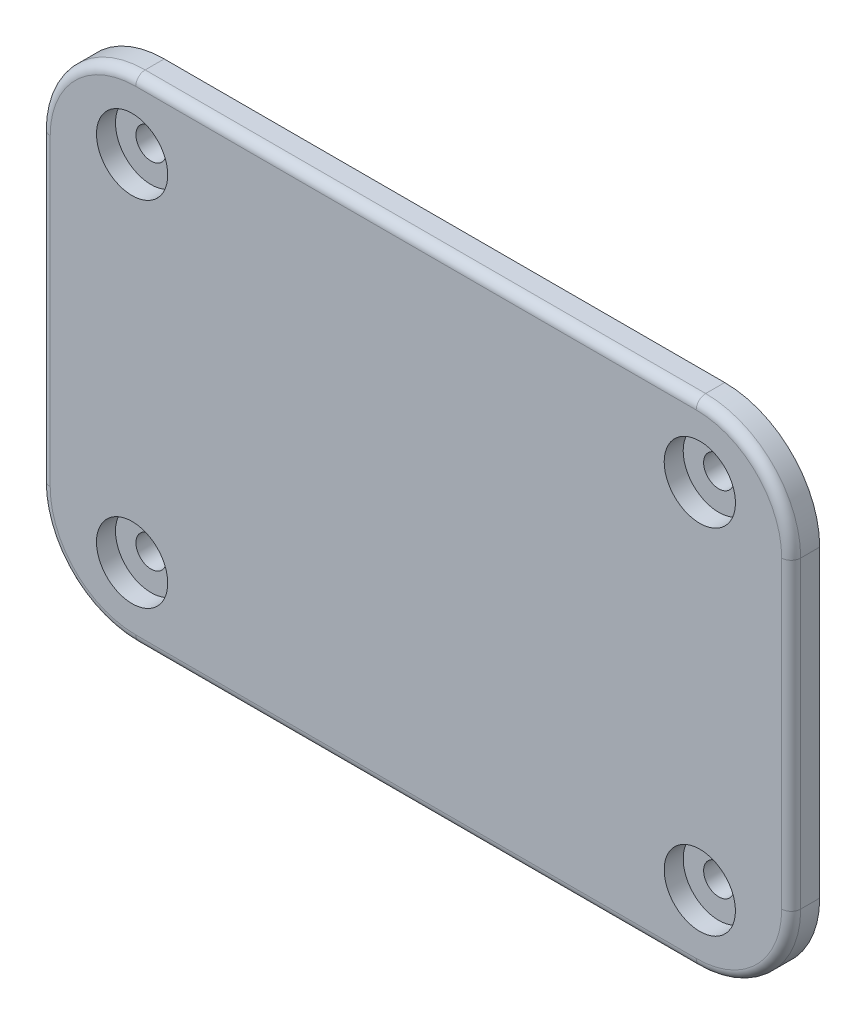
ISO-10303-21;
HEADER;
FILE_DESCRIPTION(('STEP AP214'),'2;1');
FILE_NAME('part.step','',(''),(''),'','','');
FILE_SCHEMA(('AUTOMOTIVE_DESIGN { 1 0 10303 214 1 1 1 1 }'));
ENDSEC;
DATA;
#1=APPLICATION_CONTEXT('core data for automotive mechanical design processes');
#2=APPLICATION_PROTOCOL_DEFINITION('international standard','automotive_design',2000,#1);
#3=PRODUCT_CONTEXT('',#1,'mechanical');
#4=PRODUCT('Part','Part','',(#3));
#5=PRODUCT_RELATED_PRODUCT_CATEGORY('part','',(#4));
#6=PRODUCT_DEFINITION_FORMATION('','',#4);
#7=PRODUCT_DEFINITION_CONTEXT('part definition',#1,'design');
#8=PRODUCT_DEFINITION('design','',#6,#7);
#9=PRODUCT_DEFINITION_SHAPE('','',#8);
#10=(LENGTH_UNIT() NAMED_UNIT(*) SI_UNIT(.MILLI.,.METRE.));
#11=(NAMED_UNIT(*) PLANE_ANGLE_UNIT() SI_UNIT($,.RADIAN.));
#12=(NAMED_UNIT(*) SI_UNIT($,.STERADIAN.) SOLID_ANGLE_UNIT());
#13=UNCERTAINTY_MEASURE_WITH_UNIT(LENGTH_MEASURE(1.E-05),#10,'distance_accuracy_value','');
#14=(GEOMETRIC_REPRESENTATION_CONTEXT(3) GLOBAL_UNCERTAINTY_ASSIGNED_CONTEXT((#13)) GLOBAL_UNIT_ASSIGNED_CONTEXT((#10,
#11,#12)) REPRESENTATION_CONTEXT('',''));
#15=CARTESIAN_POINT('',(0.,0.,0.));
#16=DIRECTION('',(0.,0.,1.));
#17=DIRECTION('',(1.,0.,0.));
#18=AXIS2_PLACEMENT_3D('',#15,#16,#17);
#19=CARTESIAN_POINT('',(29.879306909282,-18.5988431493967,-2.));
#20=DIRECTION('',(0.,0.,1.));
#21=DIRECTION('',(1.,0.,0.));
#22=AXIS2_PLACEMENT_3D('',#19,#20,#21);
#23=CYLINDRICAL_SURFACE('',#22,1.6);
#24=CARTESIAN_POINT('',(29.879306909282,-18.5988431493967,-1.5));
#25=DIRECTION('',(0.,0.,-1.));
#26=DIRECTION('',(-1.,0.,0.));
#27=AXIS2_PLACEMENT_3D('',#24,#25,#26);
#28=CIRCLE('',#27,1.6);
#29=CARTESIAN_POINT('',(28.279306909282,-18.5988431493967,-1.5));
#30=VERTEX_POINT('',#29);
#31=EDGE_CURVE('E297',#30,#30,#28,.T.);
#32=ORIENTED_EDGE('',*,*,#31,.T.);
#33=EDGE_LOOP('',(#32));
#34=FACE_BOUND('',#33,.T.);
#35=CARTESIAN_POINT('',(29.879306909282,-18.5988431493967,1.));
#36=DIRECTION('',(0.,0.,1.));
#37=DIRECTION('',(1.,0.,0.));
#38=AXIS2_PLACEMENT_3D('',#35,#36,#37);
#39=CIRCLE('',#38,1.6);
#40=CARTESIAN_POINT('',(31.479306909282,-18.5988431493967,1.));
#41=VERTEX_POINT('',#40);
#42=EDGE_CURVE('E40',#41,#41,#39,.F.);
#43=ORIENTED_EDGE('',*,*,#42,.F.);
#44=EDGE_LOOP('',(#43));
#45=FACE_BOUND('',#44,.T.);
#46=ADVANCED_FACE('F36',(#34,#45),#23,.F.);
#47=CARTESIAN_POINT('',(-29.879306909282,18.5988431493967,-2.));
#48=DIRECTION('',(0.,0.,1.));
#49=DIRECTION('',(1.,0.,0.));
#50=AXIS2_PLACEMENT_3D('',#47,#48,#49);
#51=CYLINDRICAL_SURFACE('',#50,1.6);
#52=CARTESIAN_POINT('',(-29.879306909282,18.5988431493967,-1.5));
#53=DIRECTION('',(0.,0.,-1.));
#54=DIRECTION('',(-1.,0.,0.));
#55=AXIS2_PLACEMENT_3D('',#52,#53,#54);
#56=CIRCLE('',#55,1.6);
#57=CARTESIAN_POINT('',(-31.479306909282,18.5988431493967,-1.5));
#58=VERTEX_POINT('',#57);
#59=EDGE_CURVE('E303',#58,#58,#56,.T.);
#60=ORIENTED_EDGE('',*,*,#59,.T.);
#61=EDGE_LOOP('',(#60));
#62=FACE_BOUND('',#61,.T.);
#63=CARTESIAN_POINT('',(-29.879306909282,18.5988431493967,1.));
#64=DIRECTION('',(0.,0.,1.));
#65=DIRECTION('',(1.,0.,0.));
#66=AXIS2_PLACEMENT_3D('',#63,#64,#65);
#67=CIRCLE('',#66,1.6);
#68=CARTESIAN_POINT('',(-28.279306909282,18.5988431493967,1.));
#69=VERTEX_POINT('',#68);
#70=EDGE_CURVE('E311',#69,#69,#67,.F.);
#71=ORIENTED_EDGE('',*,*,#70,.F.);
#72=EDGE_LOOP('',(#71));
#73=FACE_BOUND('',#72,.T.);
#74=ADVANCED_FACE('F324',(#62,#73),#51,.F.);
#75=CARTESIAN_POINT('',(29.5,-16.,0.));
#76=DIRECTION('',(0.,0.,1.));
#77=DIRECTION('',(1.,0.,0.));
#78=AXIS2_PLACEMENT_3D('',#75,#76,#77);
#79=PLANE('',#78);
#80=CARTESIAN_POINT('',(29.5,-16.,0.));
#81=DIRECTION('',(0.,0.,1.));
#82=DIRECTION('',(1.,0.,0.));
#83=AXIS2_PLACEMENT_3D('',#80,#81,#82);
#84=CIRCLE('',#83,10.);
#85=CARTESIAN_POINT('',(29.5,-26.,0.));
#86=VERTEX_POINT('',#85);
#87=CARTESIAN_POINT('',(39.5,-16.,0.));
#88=VERTEX_POINT('',#87);
#89=EDGE_CURVE('E199',#86,#88,#84,.T.);
#90=ORIENTED_EDGE('',*,*,#89,.F.);
#91=DIRECTION('',(1.,0.,0.));
#92=VECTOR('',#91,1.);
#93=CARTESIAN_POINT('',(-29.5,-26.,0.));
#94=LINE('',#93,#92);
#95=CARTESIAN_POINT('',(-29.5,-26.,0.));
#96=VERTEX_POINT('',#95);
#97=EDGE_CURVE('E225',#96,#86,#94,.T.);
#98=ORIENTED_EDGE('',*,*,#97,.F.);
#99=CARTESIAN_POINT('',(-29.5,-16.,0.));
#100=DIRECTION('',(0.,0.,1.));
#101=DIRECTION('',(-1.,0.,0.));
#102=AXIS2_PLACEMENT_3D('',#99,#100,#101);
#103=CIRCLE('',#102,10.);
#104=CARTESIAN_POINT('',(-39.5,-16.,0.));
#105=VERTEX_POINT('',#104);
#106=EDGE_CURVE('E222',#105,#96,#103,.T.);
#107=ORIENTED_EDGE('',*,*,#106,.F.);
#108=DIRECTION('',(0.,-1.,0.));
#109=VECTOR('',#108,1.);
#110=CARTESIAN_POINT('',(-39.5,-16.,0.));
#111=LINE('',#110,#109);
#112=CARTESIAN_POINT('',(-39.5,16.,0.));
#113=VERTEX_POINT('',#112);
#114=EDGE_CURVE('E219',#113,#105,#111,.T.);
#115=ORIENTED_EDGE('',*,*,#114,.F.);
#116=CARTESIAN_POINT('',(-29.5,16.,0.));
#117=DIRECTION('',(0.,0.,1.));
#118=DIRECTION('',(-1.,0.,0.));
#119=AXIS2_PLACEMENT_3D('',#116,#117,#118);
#120=CIRCLE('',#119,10.);
#121=CARTESIAN_POINT('',(-29.5,26.,0.));
#122=VERTEX_POINT('',#121);
#123=EDGE_CURVE('E216',#122,#113,#120,.T.);
#124=ORIENTED_EDGE('',*,*,#123,.F.);
#125=DIRECTION('',(-1.,0.,0.));
#126=VECTOR('',#125,1.);
#127=CARTESIAN_POINT('',(-29.5,26.,0.));
#128=LINE('',#127,#126);
#129=CARTESIAN_POINT('',(29.5,26.,0.));
#130=VERTEX_POINT('',#129);
#131=EDGE_CURVE('E213',#130,#122,#128,.T.);
#132=ORIENTED_EDGE('',*,*,#131,.F.);
#133=CARTESIAN_POINT('',(29.5,16.,0.));
#134=DIRECTION('',(0.,0.,1.));
#135=DIRECTION('',(-1.,0.,0.));
#136=AXIS2_PLACEMENT_3D('',#133,#134,#135);
#137=CIRCLE('',#136,10.);
#138=CARTESIAN_POINT('',(39.5,16.,0.));
#139=VERTEX_POINT('',#138);
#140=EDGE_CURVE('E210',#139,#130,#137,.T.);
#141=ORIENTED_EDGE('',*,*,#140,.F.);
#142=DIRECTION('',(0.,1.,0.));
#143=VECTOR('',#142,1.);
#144=CARTESIAN_POINT('',(39.5,-16.,0.));
#145=LINE('',#144,#143);
#146=EDGE_CURVE('E202',#88,#139,#145,.T.);
#147=ORIENTED_EDGE('',*,*,#146,.F.);
#148=EDGE_LOOP('',(#90,#98,#107,#115,#124,#132,#141,#147));
#149=FACE_BOUND('',#148,.T.);
#150=CARTESIAN_POINT('',(29.5,-16.,0.));
#151=DIRECTION('',(0.,0.,-1.));
#152=DIRECTION('',(-1.,0.,0.));
#153=AXIS2_PLACEMENT_3D('',#150,#151,#152);
#154=CIRCLE('',#153,5.85);
#155=CARTESIAN_POINT('',(35.35,-16.,0.));
#156=VERTEX_POINT('',#155);
#157=CARTESIAN_POINT('',(29.5,-21.85,0.));
#158=VERTEX_POINT('',#157);
#159=EDGE_CURVE('E198',#156,#158,#154,.T.);
#160=ORIENTED_EDGE('',*,*,#159,.F.);
#161=DIRECTION('',(0.,-1.,0.));
#162=VECTOR('',#161,1.);
#163=CARTESIAN_POINT('',(35.35,16.,0.));
#164=LINE('',#163,#162);
#165=CARTESIAN_POINT('',(35.35,16.,0.));
#166=VERTEX_POINT('',#165);
#167=EDGE_CURVE('E195',#166,#156,#164,.T.);
#168=ORIENTED_EDGE('',*,*,#167,.F.);
#169=CARTESIAN_POINT('',(29.5,16.,0.));
#170=DIRECTION('',(0.,0.,-1.));
#171=DIRECTION('',(-1.,0.,0.));
#172=AXIS2_PLACEMENT_3D('',#169,#170,#171);
#173=CIRCLE('',#172,5.85);
#174=CARTESIAN_POINT('',(29.5,21.85,0.));
#175=VERTEX_POINT('',#174);
#176=EDGE_CURVE('E480',#175,#166,#173,.T.);
#177=ORIENTED_EDGE('',*,*,#176,.F.);
#178=DIRECTION('',(1.,0.,0.));
#179=VECTOR('',#178,1.);
#180=CARTESIAN_POINT('',(-29.5,21.85,0.));
#181=LINE('',#180,#179);
#182=CARTESIAN_POINT('',(-29.5,21.85,0.));
#183=VERTEX_POINT('',#182);
#184=EDGE_CURVE('E512',#183,#175,#181,.T.);
#185=ORIENTED_EDGE('',*,*,#184,.F.);
#186=CARTESIAN_POINT('',(-29.5,16.,0.));
#187=DIRECTION('',(0.,0.,-1.));
#188=DIRECTION('',(-1.,0.,0.));
#189=AXIS2_PLACEMENT_3D('',#186,#187,#188);
#190=CIRCLE('',#189,5.85);
#191=CARTESIAN_POINT('',(-35.35,16.,0.));
#192=VERTEX_POINT('',#191);
#193=EDGE_CURVE('E506',#192,#183,#190,.T.);
#194=ORIENTED_EDGE('',*,*,#193,.F.);
#195=DIRECTION('',(0.,1.,0.));
#196=VECTOR('',#195,1.);
#197=CARTESIAN_POINT('',(-35.35,-16.,0.));
#198=LINE('',#197,#196);
#199=CARTESIAN_POINT('',(-35.35,-16.,0.));
#200=VERTEX_POINT('',#199);
#201=EDGE_CURVE('E501',#200,#192,#198,.T.);
#202=ORIENTED_EDGE('',*,*,#201,.F.);
#203=CARTESIAN_POINT('',(-29.5,-16.,0.));
#204=DIRECTION('',(0.,0.,-1.));
#205=DIRECTION('',(-1.,0.,0.));
#206=AXIS2_PLACEMENT_3D('',#203,#204,#205);
#207=CIRCLE('',#206,5.85);
#208=CARTESIAN_POINT('',(-29.5,-21.85,0.));
#209=VERTEX_POINT('',#208);
#210=EDGE_CURVE('E504',#209,#200,#207,.T.);
#211=ORIENTED_EDGE('',*,*,#210,.F.);
#212=DIRECTION('',(-1.,0.,0.));
#213=VECTOR('',#212,1.);
#214=CARTESIAN_POINT('',(29.5,-21.85,0.));
#215=LINE('',#214,#213);
#216=EDGE_CURVE('E474',#158,#209,#215,.T.);
#217=ORIENTED_EDGE('',*,*,#216,.F.);
#218=EDGE_LOOP('',(#160,#168,#177,#185,#194,#202,#211,#217));
#219=FACE_BOUND('',#218,.T.);
#220=ADVANCED_FACE('F330',(#149,#219),#79,.F.);
#221=CARTESIAN_POINT('',(29.5,-16.,3.));
#222=DIRECTION('',(0.,0.,-1.));
#223=DIRECTION('',(-1.,0.,0.));
#224=AXIS2_PLACEMENT_3D('',#221,#222,#223);
#225=CYLINDRICAL_SURFACE('',#224,10.);
#226=DIRECTION('',(0.,0.,-1.));
#227=VECTOR('',#226,1.);
#228=CARTESIAN_POINT('',(39.5,-16.,3.));
#229=LINE('',#228,#227);
#230=CARTESIAN_POINT('',(39.5,-16.,2.));
#231=VERTEX_POINT('',#230);
#232=EDGE_CURVE('E242',#231,#88,#229,.T.);
#233=ORIENTED_EDGE('',*,*,#232,.F.);
#234=CARTESIAN_POINT('',(29.5,-16.,2.));
#235=DIRECTION('',(0.,0.,1.));
#236=DIRECTION('',(1.,0.,0.));
#237=AXIS2_PLACEMENT_3D('',#234,#235,#236);
#238=CIRCLE('',#237,10.);
#239=CARTESIAN_POINT('',(29.5,-26.,2.));
#240=VERTEX_POINT('',#239);
#241=EDGE_CURVE('E11',#231,#240,#238,.F.);
#242=ORIENTED_EDGE('',*,*,#241,.T.);
#243=DIRECTION('',(0.,0.,-1.));
#244=VECTOR('',#243,1.);
#245=CARTESIAN_POINT('',(29.5,-26.,3.));
#246=LINE('',#245,#244);
#247=EDGE_CURVE('E228',#240,#86,#246,.T.);
#248=ORIENTED_EDGE('',*,*,#247,.T.);
#249=ORIENTED_EDGE('',*,*,#89,.T.);
#250=EDGE_LOOP('',(#233,#242,#248,#249));
#251=FACE_BOUND('',#250,.T.);
#252=ADVANCED_FACE('F374',(#251),#225,.T.);
#253=CARTESIAN_POINT('',(39.5,-16.,3.));
#254=DIRECTION('',(-1.,0.,0.));
#255=DIRECTION('',(0.,0.,1.));
#256=AXIS2_PLACEMENT_3D('',#253,#254,#255);
#257=PLANE('',#256);
#258=DIRECTION('',(0.,0.,-1.));
#259=VECTOR('',#258,1.);
#260=CARTESIAN_POINT('',(39.5,16.,3.));
#261=LINE('',#260,#259);
#262=CARTESIAN_POINT('',(39.5,16.,2.));
#263=VERTEX_POINT('',#262);
#264=EDGE_CURVE('E240',#263,#139,#261,.T.);
#265=ORIENTED_EDGE('',*,*,#264,.F.);
#266=DIRECTION('',(0.,1.,0.));
#267=VECTOR('',#266,1.);
#268=CARTESIAN_POINT('',(39.5,-16.,2.));
#269=LINE('',#268,#267);
#270=EDGE_CURVE('E45',#263,#231,#269,.F.);
#271=ORIENTED_EDGE('',*,*,#270,.T.);
#272=ORIENTED_EDGE('',*,*,#232,.T.);
#273=ORIENTED_EDGE('',*,*,#146,.T.);
#274=EDGE_LOOP('',(#265,#271,#272,#273));
#275=FACE_BOUND('',#274,.T.);
#276=ADVANCED_FACE('F398',(#275),#257,.F.);
#277=CARTESIAN_POINT('',(29.5,16.,3.));
#278=DIRECTION('',(0.,0.,-1.));
#279=DIRECTION('',(-1.,0.,0.));
#280=AXIS2_PLACEMENT_3D('',#277,#278,#279);
#281=CYLINDRICAL_SURFACE('',#280,10.);
#282=DIRECTION('',(0.,0.,-1.));
#283=VECTOR('',#282,1.);
#284=CARTESIAN_POINT('',(29.5,26.,3.));
#285=LINE('',#284,#283);
#286=CARTESIAN_POINT('',(29.5,26.,2.));
#287=VERTEX_POINT('',#286);
#288=EDGE_CURVE('E238',#287,#130,#285,.T.);
#289=ORIENTED_EDGE('',*,*,#288,.F.);
#290=CARTESIAN_POINT('',(29.5,16.,2.));
#291=DIRECTION('',(0.,0.,1.));
#292=DIRECTION('',(1.,0.,0.));
#293=AXIS2_PLACEMENT_3D('',#290,#291,#292);
#294=CIRCLE('',#293,10.);
#295=EDGE_CURVE('E60',#287,#263,#294,.F.);
#296=ORIENTED_EDGE('',*,*,#295,.T.);
#297=ORIENTED_EDGE('',*,*,#264,.T.);
#298=ORIENTED_EDGE('',*,*,#140,.T.);
#299=EDGE_LOOP('',(#289,#296,#297,#298));
#300=FACE_BOUND('',#299,.T.);
#301=ADVANCED_FACE('F394',(#300),#281,.T.);
#302=CARTESIAN_POINT('',(-29.5,26.,3.));
#303=DIRECTION('',(0.,-1.,0.));
#304=DIRECTION('',(0.,0.,-1.));
#305=AXIS2_PLACEMENT_3D('',#302,#303,#304);
#306=PLANE('',#305);
#307=DIRECTION('',(0.,0.,-1.));
#308=VECTOR('',#307,1.);
#309=CARTESIAN_POINT('',(-29.5,26.,3.));
#310=LINE('',#309,#308);
#311=CARTESIAN_POINT('',(-29.5,26.,2.));
#312=VERTEX_POINT('',#311);
#313=EDGE_CURVE('E236',#312,#122,#310,.T.);
#314=ORIENTED_EDGE('',*,*,#313,.F.);
#315=DIRECTION('',(-1.,0.,0.));
#316=VECTOR('',#315,1.);
#317=CARTESIAN_POINT('',(29.5,26.,2.));
#318=LINE('',#317,#316);
#319=EDGE_CURVE('E270',#312,#287,#318,.F.);
#320=ORIENTED_EDGE('',*,*,#319,.T.);
#321=ORIENTED_EDGE('',*,*,#288,.T.);
#322=ORIENTED_EDGE('',*,*,#131,.T.);
#323=EDGE_LOOP('',(#314,#320,#321,#322));
#324=FACE_BOUND('',#323,.T.);
#325=ADVANCED_FACE('F390',(#324),#306,.F.);
#326=CARTESIAN_POINT('',(-29.5,16.,3.));
#327=DIRECTION('',(0.,0.,-1.));
#328=DIRECTION('',(-1.,0.,0.));
#329=AXIS2_PLACEMENT_3D('',#326,#327,#328);
#330=CYLINDRICAL_SURFACE('',#329,10.);
#331=DIRECTION('',(0.,0.,-1.));
#332=VECTOR('',#331,1.);
#333=CARTESIAN_POINT('',(-39.5,16.,3.));
#334=LINE('',#333,#332);
#335=CARTESIAN_POINT('',(-39.5,16.,2.));
#336=VERTEX_POINT('',#335);
#337=EDGE_CURVE('E234',#336,#113,#334,.T.);
#338=ORIENTED_EDGE('',*,*,#337,.F.);
#339=CARTESIAN_POINT('',(-29.5,16.,2.));
#340=DIRECTION('',(0.,0.,1.));
#341=DIRECTION('',(1.,0.,0.));
#342=AXIS2_PLACEMENT_3D('',#339,#340,#341);
#343=CIRCLE('',#342,10.);
#344=EDGE_CURVE('E268',#336,#312,#343,.F.);
#345=ORIENTED_EDGE('',*,*,#344,.T.);
#346=ORIENTED_EDGE('',*,*,#313,.T.);
#347=ORIENTED_EDGE('',*,*,#123,.T.);
#348=EDGE_LOOP('',(#338,#345,#346,#347));
#349=FACE_BOUND('',#348,.T.);
#350=ADVANCED_FACE('F386',(#349),#330,.T.);
#351=CARTESIAN_POINT('',(-39.5,-16.,3.));
#352=DIRECTION('',(1.,0.,0.));
#353=DIRECTION('',(0.,0.,-1.));
#354=AXIS2_PLACEMENT_3D('',#351,#352,#353);
#355=PLANE('',#354);
#356=DIRECTION('',(0.,0.,-1.));
#357=VECTOR('',#356,1.);
#358=CARTESIAN_POINT('',(-39.5,-16.,3.));
#359=LINE('',#358,#357);
#360=CARTESIAN_POINT('',(-39.5,-16.,2.));
#361=VERTEX_POINT('',#360);
#362=EDGE_CURVE('E232',#361,#105,#359,.T.);
#363=ORIENTED_EDGE('',*,*,#362,.F.);
#364=DIRECTION('',(0.,-1.,0.));
#365=VECTOR('',#364,1.);
#366=CARTESIAN_POINT('',(-39.5,16.,2.));
#367=LINE('',#366,#365);
#368=EDGE_CURVE('E266',#361,#336,#367,.F.);
#369=ORIENTED_EDGE('',*,*,#368,.T.);
#370=ORIENTED_EDGE('',*,*,#337,.T.);
#371=ORIENTED_EDGE('',*,*,#114,.T.);
#372=EDGE_LOOP('',(#363,#369,#370,#371));
#373=FACE_BOUND('',#372,.T.);
#374=ADVANCED_FACE('F382',(#373),#355,.F.);
#375=CARTESIAN_POINT('',(-29.5,-16.,3.));
#376=DIRECTION('',(0.,0.,-1.));
#377=DIRECTION('',(-1.,0.,0.));
#378=AXIS2_PLACEMENT_3D('',#375,#376,#377);
#379=CYLINDRICAL_SURFACE('',#378,10.);
#380=DIRECTION('',(0.,0.,-1.));
#381=VECTOR('',#380,1.);
#382=CARTESIAN_POINT('',(-29.5,-26.,3.));
#383=LINE('',#382,#381);
#384=CARTESIAN_POINT('',(-29.5,-26.,2.));
#385=VERTEX_POINT('',#384);
#386=EDGE_CURVE('E230',#385,#96,#383,.T.);
#387=ORIENTED_EDGE('',*,*,#386,.F.);
#388=CARTESIAN_POINT('',(-29.5,-16.,2.));
#389=DIRECTION('',(0.,0.,1.));
#390=DIRECTION('',(1.,0.,0.));
#391=AXIS2_PLACEMENT_3D('',#388,#389,#390);
#392=CIRCLE('',#391,10.);
#393=EDGE_CURVE('E264',#385,#361,#392,.F.);
#394=ORIENTED_EDGE('',*,*,#393,.T.);
#395=ORIENTED_EDGE('',*,*,#362,.T.);
#396=ORIENTED_EDGE('',*,*,#106,.T.);
#397=EDGE_LOOP('',(#387,#394,#395,#396));
#398=FACE_BOUND('',#397,.T.);
#399=ADVANCED_FACE('F378',(#398),#379,.T.);
#400=CARTESIAN_POINT('',(-29.5,-26.,3.));
#401=DIRECTION('',(0.,1.,0.));
#402=DIRECTION('',(0.,0.,1.));
#403=AXIS2_PLACEMENT_3D('',#400,#401,#402);
#404=PLANE('',#403);
#405=ORIENTED_EDGE('',*,*,#247,.F.);
#406=DIRECTION('',(1.,0.,0.));
#407=VECTOR('',#406,1.);
#408=CARTESIAN_POINT('',(-29.5,-26.,2.));
#409=LINE('',#408,#407);
#410=EDGE_CURVE('E261',#240,#385,#409,.F.);
#411=ORIENTED_EDGE('',*,*,#410,.T.);
#412=ORIENTED_EDGE('',*,*,#386,.T.);
#413=ORIENTED_EDGE('',*,*,#97,.T.);
#414=EDGE_LOOP('',(#405,#411,#412,#413));
#415=FACE_BOUND('',#414,.T.);
#416=ADVANCED_FACE('F370',(#415),#404,.F.);
#417=CARTESIAN_POINT('',(29.5,-16.,3.));
#418=DIRECTION('',(0.,0.,1.));
#419=DIRECTION('',(1.,0.,0.));
#420=AXIS2_PLACEMENT_3D('',#417,#418,#419);
#421=PLANE('',#420);
#422=CARTESIAN_POINT('',(29.879306909282,18.5988431493967,3.));
#423=DIRECTION('',(0.,0.,1.));
#424=DIRECTION('',(-1.,0.,0.));
#425=AXIS2_PLACEMENT_3D('',#422,#423,#424);
#426=CIRCLE('',#425,3.75000000000001);
#427=CARTESIAN_POINT('',(26.129306909282,18.5988431493967,3.));
#428=VERTEX_POINT('',#427);
#429=EDGE_CURVE('E536',#428,#428,#426,.T.);
#430=ORIENTED_EDGE('',*,*,#429,.F.);
#431=EDGE_LOOP('',(#430));
#432=FACE_BOUND('',#431,.T.);
#433=CARTESIAN_POINT('',(-29.879306909282,18.5988431493967,3.));
#434=DIRECTION('',(0.,0.,1.));
#435=DIRECTION('',(1.,0.,0.));
#436=AXIS2_PLACEMENT_3D('',#433,#434,#435);
#437=CIRCLE('',#436,3.75);
#438=CARTESIAN_POINT('',(-26.129306909282,18.5988431493967,3.));
#439=VERTEX_POINT('',#438);
#440=EDGE_CURVE('E542',#439,#439,#437,.T.);
#441=ORIENTED_EDGE('',*,*,#440,.F.);
#442=EDGE_LOOP('',(#441));
#443=FACE_BOUND('',#442,.T.);
#444=CARTESIAN_POINT('',(-29.879306909282,-18.5988431493967,3.));
#445=DIRECTION('',(0.,0.,1.));
#446=DIRECTION('',(-1.,0.,0.));
#447=AXIS2_PLACEMENT_3D('',#444,#445,#446);
#448=CIRCLE('',#447,3.75);
#449=CARTESIAN_POINT('',(-33.629306909282,-18.5988431493967,3.));
#450=VERTEX_POINT('',#449);
#451=EDGE_CURVE('E530',#450,#450,#448,.T.);
#452=ORIENTED_EDGE('',*,*,#451,.F.);
#453=EDGE_LOOP('',(#452));
#454=FACE_BOUND('',#453,.T.);
#455=CARTESIAN_POINT('',(29.879306909282,-18.5988431493967,3.));
#456=DIRECTION('',(0.,0.,1.));
#457=DIRECTION('',(1.,0.,0.));
#458=AXIS2_PLACEMENT_3D('',#455,#456,#457);
#459=CIRCLE('',#458,3.75000000000001);
#460=CARTESIAN_POINT('',(33.629306909282,-18.5988431493967,3.));
#461=VERTEX_POINT('',#460);
#462=EDGE_CURVE('E527',#461,#461,#459,.T.);
#463=ORIENTED_EDGE('',*,*,#462,.F.);
#464=EDGE_LOOP('',(#463));
#465=FACE_BOUND('',#464,.T.);
#466=CARTESIAN_POINT('',(-29.5,-16.,3.));
#467=DIRECTION('',(0.,0.,1.));
#468=DIRECTION('',(1.,0.,0.));
#469=AXIS2_PLACEMENT_3D('',#466,#467,#468);
#470=CIRCLE('',#469,9.);
#471=CARTESIAN_POINT('',(-38.5,-16.,3.));
#472=VERTEX_POINT('',#471);
#473=CARTESIAN_POINT('',(-29.5,-25.,3.));
#474=VERTEX_POINT('',#473);
#475=EDGE_CURVE('E256',#472,#474,#470,.T.);
#476=ORIENTED_EDGE('',*,*,#475,.T.);
#477=DIRECTION('',(1.,0.,0.));
#478=VECTOR('',#477,1.);
#479=CARTESIAN_POINT('',(29.5,-25.,3.));
#480=LINE('',#479,#478);
#481=CARTESIAN_POINT('',(29.5,-25.,3.));
#482=VERTEX_POINT('',#481);
#483=EDGE_CURVE('E258',#474,#482,#480,.T.);
#484=ORIENTED_EDGE('',*,*,#483,.T.);
#485=CARTESIAN_POINT('',(29.5,-16.,3.));
#486=DIRECTION('',(0.,0.,1.));
#487=DIRECTION('',(1.,0.,0.));
#488=AXIS2_PLACEMENT_3D('',#485,#486,#487);
#489=CIRCLE('',#488,9.);
#490=CARTESIAN_POINT('',(38.5,-16.,3.));
#491=VERTEX_POINT('',#490);
#492=EDGE_CURVE('E244',#482,#491,#489,.T.);
#493=ORIENTED_EDGE('',*,*,#492,.T.);
#494=DIRECTION('',(0.,1.,0.));
#495=VECTOR('',#494,1.);
#496=CARTESIAN_POINT('',(38.5,16.,3.));
#497=LINE('',#496,#495);
#498=CARTESIAN_POINT('',(38.5,16.,3.));
#499=VERTEX_POINT('',#498);
#500=EDGE_CURVE('E246',#491,#499,#497,.T.);
#501=ORIENTED_EDGE('',*,*,#500,.T.);
#502=CARTESIAN_POINT('',(29.5,16.,3.));
#503=DIRECTION('',(0.,0.,1.));
#504=DIRECTION('',(1.,0.,0.));
#505=AXIS2_PLACEMENT_3D('',#502,#503,#504);
#506=CIRCLE('',#505,9.);
#507=CARTESIAN_POINT('',(29.5,25.,3.));
#508=VERTEX_POINT('',#507);
#509=EDGE_CURVE('E248',#499,#508,#506,.T.);
#510=ORIENTED_EDGE('',*,*,#509,.T.);
#511=DIRECTION('',(-1.,0.,0.));
#512=VECTOR('',#511,1.);
#513=CARTESIAN_POINT('',(-29.5,25.,3.));
#514=LINE('',#513,#512);
#515=CARTESIAN_POINT('',(-29.5,25.,3.));
#516=VERTEX_POINT('',#515);
#517=EDGE_CURVE('E250',#508,#516,#514,.T.);
#518=ORIENTED_EDGE('',*,*,#517,.T.);
#519=CARTESIAN_POINT('',(-29.5,16.,3.));
#520=DIRECTION('',(0.,0.,1.));
#521=DIRECTION('',(1.,0.,0.));
#522=AXIS2_PLACEMENT_3D('',#519,#520,#521);
#523=CIRCLE('',#522,9.);
#524=CARTESIAN_POINT('',(-38.5,16.,3.));
#525=VERTEX_POINT('',#524);
#526=EDGE_CURVE('E252',#516,#525,#523,.T.);
#527=ORIENTED_EDGE('',*,*,#526,.T.);
#528=DIRECTION('',(0.,-1.,0.));
#529=VECTOR('',#528,1.);
#530=CARTESIAN_POINT('',(-38.5,-16.,3.));
#531=LINE('',#530,#529);
#532=EDGE_CURVE('E254',#525,#472,#531,.T.);
#533=ORIENTED_EDGE('',*,*,#532,.T.);
#534=EDGE_LOOP('',(#476,#484,#493,#501,#510,#518,#527,#533));
#535=FACE_BOUND('',#534,.T.);
#536=ADVANCED_FACE('F367',(#432,#443,#454,#465,#535),#421,.T.);
#537=CARTESIAN_POINT('',(29.5,-16.,-1.5));
#538=DIRECTION('',(0.,0.,1.));
#539=DIRECTION('',(1.,0.,0.));
#540=AXIS2_PLACEMENT_3D('',#537,#538,#539);
#541=CYLINDRICAL_SURFACE('',#540,5.85);
#542=ORIENTED_EDGE('',*,*,#159,.T.);
#543=DIRECTION('',(0.,0.,1.));
#544=VECTOR('',#543,1.);
#545=CARTESIAN_POINT('',(29.5,-21.85,-1.5));
#546=LINE('',#545,#544);
#547=CARTESIAN_POINT('',(29.5,-21.85,-1.5));
#548=VERTEX_POINT('',#547);
#549=EDGE_CURVE('E179',#548,#158,#546,.T.);
#550=ORIENTED_EDGE('',*,*,#549,.F.);
#551=CARTESIAN_POINT('',(29.5,-16.,-1.5));
#552=DIRECTION('',(0.,0.,-1.));
#553=DIRECTION('',(-1.,0.,0.));
#554=AXIS2_PLACEMENT_3D('',#551,#552,#553);
#555=CIRCLE('',#554,5.85);
#556=CARTESIAN_POINT('',(35.35,-16.,-1.5));
#557=VERTEX_POINT('',#556);
#558=EDGE_CURVE('E186',#557,#548,#555,.T.);
#559=ORIENTED_EDGE('',*,*,#558,.F.);
#560=DIRECTION('',(0.,0.,1.));
#561=VECTOR('',#560,1.);
#562=CARTESIAN_POINT('',(35.35,-16.,-1.5));
#563=LINE('',#562,#561);
#564=EDGE_CURVE('E477',#557,#156,#563,.T.);
#565=ORIENTED_EDGE('',*,*,#564,.T.);
#566=EDGE_LOOP('',(#542,#550,#559,#565));
#567=FACE_BOUND('',#566,.T.);
#568=ADVANCED_FACE('F197',(#567),#541,.T.);
#569=CARTESIAN_POINT('',(29.5,-21.85,-1.5));
#570=DIRECTION('',(0.,1.,0.));
#571=DIRECTION('',(0.,0.,1.));
#572=AXIS2_PLACEMENT_3D('',#569,#570,#571);
#573=PLANE('',#572);
#574=ORIENTED_EDGE('',*,*,#216,.T.);
#575=DIRECTION('',(0.,0.,1.));
#576=VECTOR('',#575,1.);
#577=CARTESIAN_POINT('',(-29.5,-21.85,-1.5));
#578=LINE('',#577,#576);
#579=CARTESIAN_POINT('',(-29.5,-21.85,-1.5));
#580=VERTEX_POINT('',#579);
#581=EDGE_CURVE('E182',#580,#209,#578,.T.);
#582=ORIENTED_EDGE('',*,*,#581,.F.);
#583=DIRECTION('',(-1.,0.,0.));
#584=VECTOR('',#583,1.);
#585=CARTESIAN_POINT('',(29.5,-21.85,-1.5));
#586=LINE('',#585,#584);
#587=EDGE_CURVE('E174',#548,#580,#586,.T.);
#588=ORIENTED_EDGE('',*,*,#587,.F.);
#589=ORIENTED_EDGE('',*,*,#549,.T.);
#590=EDGE_LOOP('',(#574,#582,#588,#589));
#591=FACE_BOUND('',#590,.T.);
#592=ADVANCED_FACE('F177',(#591),#573,.F.);
#593=CARTESIAN_POINT('',(-29.5,-16.,-1.5));
#594=DIRECTION('',(0.,0.,1.));
#595=DIRECTION('',(1.,0.,0.));
#596=AXIS2_PLACEMENT_3D('',#593,#594,#595);
#597=CYLINDRICAL_SURFACE('',#596,5.85);
#598=ORIENTED_EDGE('',*,*,#210,.T.);
#599=DIRECTION('',(0.,0.,1.));
#600=VECTOR('',#599,1.);
#601=CARTESIAN_POINT('',(-35.35,-16.,-1.5));
#602=LINE('',#601,#600);
#603=CARTESIAN_POINT('',(-35.35,-16.,-1.5));
#604=VERTEX_POINT('',#603);
#605=EDGE_CURVE('E204',#604,#200,#602,.T.);
#606=ORIENTED_EDGE('',*,*,#605,.F.);
#607=CARTESIAN_POINT('',(-29.5,-16.,-1.5));
#608=DIRECTION('',(0.,0.,-1.));
#609=DIRECTION('',(-1.,0.,0.));
#610=AXIS2_PLACEMENT_3D('',#607,#608,#609);
#611=CIRCLE('',#610,5.85);
#612=EDGE_CURVE('E185',#580,#604,#611,.T.);
#613=ORIENTED_EDGE('',*,*,#612,.F.);
#614=ORIENTED_EDGE('',*,*,#581,.T.);
#615=EDGE_LOOP('',(#598,#606,#613,#614));
#616=FACE_BOUND('',#615,.T.);
#617=ADVANCED_FACE('F358',(#616),#597,.T.);
#618=CARTESIAN_POINT('',(-35.35,-16.,-1.5));
#619=DIRECTION('',(1.,0.,0.));
#620=DIRECTION('',(0.,0.,-1.));
#621=AXIS2_PLACEMENT_3D('',#618,#619,#620);
#622=PLANE('',#621);
#623=ORIENTED_EDGE('',*,*,#201,.T.);
#624=DIRECTION('',(0.,0.,1.));
#625=VECTOR('',#624,1.);
#626=CARTESIAN_POINT('',(-35.35,16.,-1.5));
#627=LINE('',#626,#625);
#628=CARTESIAN_POINT('',(-35.35,16.,-1.5));
#629=VERTEX_POINT('',#628);
#630=EDGE_CURVE('E494',#629,#192,#627,.T.);
#631=ORIENTED_EDGE('',*,*,#630,.F.);
#632=DIRECTION('',(0.,1.,0.));
#633=VECTOR('',#632,1.);
#634=CARTESIAN_POINT('',(-35.35,-16.,-1.5));
#635=LINE('',#634,#633);
#636=EDGE_CURVE('E502',#604,#629,#635,.T.);
#637=ORIENTED_EDGE('',*,*,#636,.F.);
#638=ORIENTED_EDGE('',*,*,#605,.T.);
#639=EDGE_LOOP('',(#623,#631,#637,#638));
#640=FACE_BOUND('',#639,.T.);
#641=ADVANCED_FACE('F354',(#640),#622,.F.);
#642=CARTESIAN_POINT('',(-29.5,16.,-1.5));
#643=DIRECTION('',(0.,0.,1.));
#644=DIRECTION('',(1.,0.,0.));
#645=AXIS2_PLACEMENT_3D('',#642,#643,#644);
#646=CYLINDRICAL_SURFACE('',#645,5.85);
#647=ORIENTED_EDGE('',*,*,#193,.T.);
#648=DIRECTION('',(0.,0.,1.));
#649=VECTOR('',#648,1.);
#650=CARTESIAN_POINT('',(-29.5,21.85,-1.5));
#651=LINE('',#650,#649);
#652=CARTESIAN_POINT('',(-29.5,21.85,-1.5));
#653=VERTEX_POINT('',#652);
#654=EDGE_CURVE('E491',#653,#183,#651,.T.);
#655=ORIENTED_EDGE('',*,*,#654,.F.);
#656=CARTESIAN_POINT('',(-29.5,16.,-1.5));
#657=DIRECTION('',(0.,0.,-1.));
#658=DIRECTION('',(-1.,0.,0.));
#659=AXIS2_PLACEMENT_3D('',#656,#657,#658);
#660=CIRCLE('',#659,5.85);
#661=EDGE_CURVE('E520',#629,#653,#660,.T.);
#662=ORIENTED_EDGE('',*,*,#661,.F.);
#663=ORIENTED_EDGE('',*,*,#630,.T.);
#664=EDGE_LOOP('',(#647,#655,#662,#663));
#665=FACE_BOUND('',#664,.T.);
#666=ADVANCED_FACE('F350',(#665),#646,.T.);
#667=CARTESIAN_POINT('',(-29.5,21.85,-1.5));
#668=DIRECTION('',(0.,-1.,0.));
#669=DIRECTION('',(0.,0.,-1.));
#670=AXIS2_PLACEMENT_3D('',#667,#668,#669);
#671=PLANE('',#670);
#672=ORIENTED_EDGE('',*,*,#184,.T.);
#673=DIRECTION('',(0.,0.,1.));
#674=VECTOR('',#673,1.);
#675=CARTESIAN_POINT('',(29.5,21.85,-1.5));
#676=LINE('',#675,#674);
#677=CARTESIAN_POINT('',(29.5,21.85,-1.5));
#678=VERTEX_POINT('',#677);
#679=EDGE_CURVE('E483',#678,#175,#676,.T.);
#680=ORIENTED_EDGE('',*,*,#679,.F.);
#681=DIRECTION('',(1.,0.,0.));
#682=VECTOR('',#681,1.);
#683=CARTESIAN_POINT('',(-29.5,21.85,-1.5));
#684=LINE('',#683,#682);
#685=EDGE_CURVE('E518',#653,#678,#684,.T.);
#686=ORIENTED_EDGE('',*,*,#685,.F.);
#687=ORIENTED_EDGE('',*,*,#654,.T.);
#688=EDGE_LOOP('',(#672,#680,#686,#687));
#689=FACE_BOUND('',#688,.T.);
#690=ADVANCED_FACE('F346',(#689),#671,.F.);
#691=CARTESIAN_POINT('',(29.5,16.,-1.5));
#692=DIRECTION('',(0.,0.,1.));
#693=DIRECTION('',(1.,0.,0.));
#694=AXIS2_PLACEMENT_3D('',#691,#692,#693);
#695=CYLINDRICAL_SURFACE('',#694,5.85);
#696=ORIENTED_EDGE('',*,*,#176,.T.);
#697=DIRECTION('',(0.,0.,1.));
#698=VECTOR('',#697,1.);
#699=CARTESIAN_POINT('',(35.35,16.,-1.5));
#700=LINE('',#699,#698);
#701=CARTESIAN_POINT('',(35.35,16.,-1.5));
#702=VERTEX_POINT('',#701);
#703=EDGE_CURVE('E479',#702,#166,#700,.T.);
#704=ORIENTED_EDGE('',*,*,#703,.F.);
#705=CARTESIAN_POINT('',(29.5,16.,-1.5));
#706=DIRECTION('',(0.,0.,-1.));
#707=DIRECTION('',(-1.,0.,0.));
#708=AXIS2_PLACEMENT_3D('',#705,#706,#707);
#709=CIRCLE('',#708,5.85);
#710=EDGE_CURVE('E485',#678,#702,#709,.T.);
#711=ORIENTED_EDGE('',*,*,#710,.F.);
#712=ORIENTED_EDGE('',*,*,#679,.T.);
#713=EDGE_LOOP('',(#696,#704,#711,#712));
#714=FACE_BOUND('',#713,.T.);
#715=ADVANCED_FACE('F342',(#714),#695,.T.);
#716=CARTESIAN_POINT('',(35.35,16.,-1.5));
#717=DIRECTION('',(-1.,0.,0.));
#718=DIRECTION('',(0.,0.,1.));
#719=AXIS2_PLACEMENT_3D('',#716,#717,#718);
#720=PLANE('',#719);
#721=ORIENTED_EDGE('',*,*,#167,.T.);
#722=ORIENTED_EDGE('',*,*,#564,.F.);
#723=DIRECTION('',(0.,-1.,0.));
#724=VECTOR('',#723,1.);
#725=CARTESIAN_POINT('',(35.35,16.,-1.5));
#726=LINE('',#725,#724);
#727=EDGE_CURVE('E191',#702,#557,#726,.T.);
#728=ORIENTED_EDGE('',*,*,#727,.F.);
#729=ORIENTED_EDGE('',*,*,#703,.T.);
#730=EDGE_LOOP('',(#721,#722,#728,#729));
#731=FACE_BOUND('',#730,.T.);
#732=ADVANCED_FACE('F338',(#731),#720,.F.);
#733=CARTESIAN_POINT('',(29.5,-16.,-1.5));
#734=DIRECTION('',(0.,0.,-1.));
#735=DIRECTION('',(-1.,0.,0.));
#736=AXIS2_PLACEMENT_3D('',#733,#734,#735);
#737=PLANE('',#736);
#738=CARTESIAN_POINT('',(29.879306909282,18.5988431493967,-1.5));
#739=DIRECTION('',(0.,0.,-1.));
#740=DIRECTION('',(-1.,0.,0.));
#741=AXIS2_PLACEMENT_3D('',#738,#739,#740);
#742=CIRCLE('',#741,1.6);
#743=CARTESIAN_POINT('',(28.279306909282,18.5988431493967,-1.5));
#744=VERTEX_POINT('',#743);
#745=EDGE_CURVE('E277',#744,#744,#742,.T.);
#746=ORIENTED_EDGE('',*,*,#745,.F.);
#747=EDGE_LOOP('',(#746));
#748=FACE_BOUND('',#747,.T.);
#749=ORIENTED_EDGE('',*,*,#59,.F.);
#750=EDGE_LOOP('',(#749));
#751=FACE_BOUND('',#750,.T.);
#752=CARTESIAN_POINT('',(-29.879306909282,-18.5988431493967,-1.5));
#753=DIRECTION('',(0.,0.,-1.));
#754=DIRECTION('',(-1.,0.,0.));
#755=AXIS2_PLACEMENT_3D('',#752,#753,#754);
#756=CIRCLE('',#755,1.6);
#757=CARTESIAN_POINT('',(-31.479306909282,-18.5988431493967,-1.5));
#758=VERTEX_POINT('',#757);
#759=EDGE_CURVE('E300',#758,#758,#756,.T.);
#760=ORIENTED_EDGE('',*,*,#759,.F.);
#761=EDGE_LOOP('',(#760));
#762=FACE_BOUND('',#761,.T.);
#763=ORIENTED_EDGE('',*,*,#31,.F.);
#764=EDGE_LOOP('',(#763));
#765=FACE_BOUND('',#764,.T.);
#766=ORIENTED_EDGE('',*,*,#558,.T.);
#767=ORIENTED_EDGE('',*,*,#587,.T.);
#768=ORIENTED_EDGE('',*,*,#612,.T.);
#769=ORIENTED_EDGE('',*,*,#636,.T.);
#770=ORIENTED_EDGE('',*,*,#661,.T.);
#771=ORIENTED_EDGE('',*,*,#685,.T.);
#772=ORIENTED_EDGE('',*,*,#710,.T.);
#773=ORIENTED_EDGE('',*,*,#727,.T.);
#774=EDGE_LOOP('',(#766,#767,#768,#769,#770,#771,#772,#773));
#775=FACE_BOUND('',#774,.T.);
#776=ADVANCED_FACE('F189',(#748,#751,#762,#765,#775),#737,.T.);
#777=CARTESIAN_POINT('',(29.5,25.,2.));
#778=DIRECTION('',(1.,0.,0.));
#779=DIRECTION('',(0.,0.,-1.));
#780=AXIS2_PLACEMENT_3D('',#777,#778,#779);
#781=CYLINDRICAL_SURFACE('',#780,1.);
#782=CARTESIAN_POINT('',(29.5,25.,2.));
#783=DIRECTION('',(1.,0.,0.));
#784=DIRECTION('',(0.,0.,-1.));
#785=AXIS2_PLACEMENT_3D('',#782,#783,#784);
#786=CIRCLE('',#785,1.);
#787=EDGE_CURVE('E291',#287,#508,#786,.T.);
#788=ORIENTED_EDGE('',*,*,#787,.F.);
#789=ORIENTED_EDGE('',*,*,#319,.F.);
#790=CARTESIAN_POINT('',(-29.5,25.,2.));
#791=DIRECTION('',(-1.,0.,0.));
#792=DIRECTION('',(0.,0.,1.));
#793=AXIS2_PLACEMENT_3D('',#790,#791,#792);
#794=CIRCLE('',#793,1.);
#795=EDGE_CURVE('E294',#516,#312,#794,.T.);
#796=ORIENTED_EDGE('',*,*,#795,.F.);
#797=ORIENTED_EDGE('',*,*,#517,.F.);
#798=EDGE_LOOP('',(#788,#789,#796,#797));
#799=FACE_BOUND('',#798,.T.);
#800=ADVANCED_FACE('F38',(#799),#781,.T.);
#801=CARTESIAN_POINT('',(-29.5,16.,2.));
#802=DIRECTION('',(0.,0.,1.));
#803=DIRECTION('',(1.,0.,0.));
#804=AXIS2_PLACEMENT_3D('',#801,#802,#803);
#805=TOROIDAL_SURFACE('',#804,9.,1.);
#806=ORIENTED_EDGE('',*,*,#795,.T.);
#807=ORIENTED_EDGE('',*,*,#344,.F.);
#808=CARTESIAN_POINT('',(-38.5,16.,2.));
#809=DIRECTION('',(0.,-1.,0.));
#810=DIRECTION('',(0.,0.,-1.));
#811=AXIS2_PLACEMENT_3D('',#808,#809,#810);
#812=CIRCLE('',#811,1.);
#813=EDGE_CURVE('E288',#525,#336,#812,.T.);
#814=ORIENTED_EDGE('',*,*,#813,.F.);
#815=ORIENTED_EDGE('',*,*,#526,.F.);
#816=EDGE_LOOP('',(#806,#807,#814,#815));
#817=FACE_BOUND('',#816,.T.);
#818=ADVANCED_FACE('F427',(#817),#805,.T.);
#819=CARTESIAN_POINT('',(29.5,16.,2.));
#820=DIRECTION('',(0.,0.,1.));
#821=DIRECTION('',(1.,0.,0.));
#822=AXIS2_PLACEMENT_3D('',#819,#820,#821);
#823=TOROIDAL_SURFACE('',#822,9.,1.);
#824=ORIENTED_EDGE('',*,*,#787,.T.);
#825=ORIENTED_EDGE('',*,*,#509,.F.);
#826=CARTESIAN_POINT('',(38.5,16.,2.));
#827=DIRECTION('',(0.,-1.,0.));
#828=DIRECTION('',(0.,0.,-1.));
#829=AXIS2_PLACEMENT_3D('',#826,#827,#828);
#830=CIRCLE('',#829,1.);
#831=EDGE_CURVE('E285',#263,#499,#830,.T.);
#832=ORIENTED_EDGE('',*,*,#831,.F.);
#833=ORIENTED_EDGE('',*,*,#295,.F.);
#834=EDGE_LOOP('',(#824,#825,#832,#833));
#835=FACE_BOUND('',#834,.T.);
#836=ADVANCED_FACE('F424',(#835),#823,.T.);
#837=CARTESIAN_POINT('',(-38.5,-16.,2.));
#838=DIRECTION('',(0.,1.,0.));
#839=DIRECTION('',(0.,0.,1.));
#840=AXIS2_PLACEMENT_3D('',#837,#838,#839);
#841=CYLINDRICAL_SURFACE('',#840,1.);
#842=ORIENTED_EDGE('',*,*,#813,.T.);
#843=ORIENTED_EDGE('',*,*,#368,.F.);
#844=CARTESIAN_POINT('',(-38.5,-16.,2.));
#845=DIRECTION('',(0.,-1.,0.));
#846=DIRECTION('',(0.,0.,-1.));
#847=AXIS2_PLACEMENT_3D('',#844,#845,#846);
#848=CIRCLE('',#847,1.);
#849=EDGE_CURVE('E282',#472,#361,#848,.T.);
#850=ORIENTED_EDGE('',*,*,#849,.F.);
#851=ORIENTED_EDGE('',*,*,#532,.F.);
#852=EDGE_LOOP('',(#842,#843,#850,#851));
#853=FACE_BOUND('',#852,.T.);
#854=ADVANCED_FACE('F420',(#853),#841,.T.);
#855=CARTESIAN_POINT('',(38.5,-16.,2.));
#856=DIRECTION('',(0.,-1.,0.));
#857=DIRECTION('',(0.,0.,-1.));
#858=AXIS2_PLACEMENT_3D('',#855,#856,#857);
#859=CYLINDRICAL_SURFACE('',#858,1.);
#860=ORIENTED_EDGE('',*,*,#831,.T.);
#861=ORIENTED_EDGE('',*,*,#500,.F.);
#862=CARTESIAN_POINT('',(38.5,-16.,2.));
#863=DIRECTION('',(0.,-1.,0.));
#864=DIRECTION('',(0.,0.,-1.));
#865=AXIS2_PLACEMENT_3D('',#862,#863,#864);
#866=CIRCLE('',#865,1.);
#867=EDGE_CURVE('E279',#231,#491,#866,.T.);
#868=ORIENTED_EDGE('',*,*,#867,.F.);
#869=ORIENTED_EDGE('',*,*,#270,.F.);
#870=EDGE_LOOP('',(#860,#861,#868,#869));
#871=FACE_BOUND('',#870,.T.);
#872=ADVANCED_FACE('F416',(#871),#859,.T.);
#873=CARTESIAN_POINT('',(-29.5,-16.,2.));
#874=DIRECTION('',(0.,0.,1.));
#875=DIRECTION('',(1.,0.,0.));
#876=AXIS2_PLACEMENT_3D('',#873,#874,#875);
#877=TOROIDAL_SURFACE('',#876,9.,1.);
#878=ORIENTED_EDGE('',*,*,#849,.T.);
#879=ORIENTED_EDGE('',*,*,#393,.F.);
#880=CARTESIAN_POINT('',(-29.5,-25.,2.));
#881=DIRECTION('',(1.,0.,0.));
#882=DIRECTION('',(0.,0.,-1.));
#883=AXIS2_PLACEMENT_3D('',#880,#881,#882);
#884=CIRCLE('',#883,1.);
#885=EDGE_CURVE('E276',#474,#385,#884,.T.);
#886=ORIENTED_EDGE('',*,*,#885,.F.);
#887=ORIENTED_EDGE('',*,*,#475,.F.);
#888=EDGE_LOOP('',(#878,#879,#886,#887));
#889=FACE_BOUND('',#888,.T.);
#890=ADVANCED_FACE('F412',(#889),#877,.T.);
#891=CARTESIAN_POINT('',(29.5,-16.,2.));
#892=DIRECTION('',(0.,0.,1.));
#893=DIRECTION('',(1.,0.,0.));
#894=AXIS2_PLACEMENT_3D('',#891,#892,#893);
#895=TOROIDAL_SURFACE('',#894,9.,1.);
#896=ORIENTED_EDGE('',*,*,#867,.T.);
#897=ORIENTED_EDGE('',*,*,#492,.F.);
#898=CARTESIAN_POINT('',(29.5,-25.,2.));
#899=DIRECTION('',(-1.,0.,0.));
#900=DIRECTION('',(0.,0.,1.));
#901=AXIS2_PLACEMENT_3D('',#898,#899,#900);
#902=CIRCLE('',#901,1.);
#903=EDGE_CURVE('E274',#240,#482,#902,.T.);
#904=ORIENTED_EDGE('',*,*,#903,.F.);
#905=ORIENTED_EDGE('',*,*,#241,.F.);
#906=EDGE_LOOP('',(#896,#897,#904,#905));
#907=FACE_BOUND('',#906,.T.);
#908=ADVANCED_FACE('F408',(#907),#895,.T.);
#909=CARTESIAN_POINT('',(29.5,-25.,2.));
#910=DIRECTION('',(-1.,0.,0.));
#911=DIRECTION('',(0.,0.,1.));
#912=AXIS2_PLACEMENT_3D('',#909,#910,#911);
#913=CYLINDRICAL_SURFACE('',#912,1.);
#914=ORIENTED_EDGE('',*,*,#885,.T.);
#915=ORIENTED_EDGE('',*,*,#410,.F.);
#916=ORIENTED_EDGE('',*,*,#903,.T.);
#917=ORIENTED_EDGE('',*,*,#483,.F.);
#918=EDGE_LOOP('',(#914,#915,#916,#917));
#919=FACE_BOUND('',#918,.T.);
#920=ADVANCED_FACE('F404',(#919),#913,.T.);
#921=CARTESIAN_POINT('',(-29.879306909282,-18.5988431493967,-2.));
#922=DIRECTION('',(0.,0.,1.));
#923=DIRECTION('',(1.,0.,0.));
#924=AXIS2_PLACEMENT_3D('',#921,#922,#923);
#925=CYLINDRICAL_SURFACE('',#924,1.6);
#926=CARTESIAN_POINT('',(-29.879306909282,-18.5988431493967,1.));
#927=DIRECTION('',(0.,0.,-1.));
#928=DIRECTION('',(-1.,0.,0.));
#929=AXIS2_PLACEMENT_3D('',#926,#927,#928);
#930=CIRCLE('',#929,1.6);
#931=CARTESIAN_POINT('',(-31.479306909282,-18.5988431493967,1.));
#932=VERTEX_POINT('',#931);
#933=EDGE_CURVE('E314',#932,#932,#930,.F.);
#934=ORIENTED_EDGE('',*,*,#933,.T.);
#935=EDGE_LOOP('',(#934));
#936=FACE_BOUND('',#935,.T.);
#937=ORIENTED_EDGE('',*,*,#759,.T.);
#938=EDGE_LOOP('',(#937));
#939=FACE_BOUND('',#938,.T.);
#940=ADVANCED_FACE('F407',(#936,#939),#925,.F.);
#941=CARTESIAN_POINT('',(29.879306909282,18.5988431493967,-2.));
#942=DIRECTION('',(0.,0.,1.));
#943=DIRECTION('',(1.,0.,0.));
#944=AXIS2_PLACEMENT_3D('',#941,#942,#943);
#945=CYLINDRICAL_SURFACE('',#944,1.6);
#946=CARTESIAN_POINT('',(29.879306909282,18.5988431493967,1.));
#947=DIRECTION('',(0.,0.,-1.));
#948=DIRECTION('',(-1.,0.,0.));
#949=AXIS2_PLACEMENT_3D('',#946,#947,#948);
#950=CIRCLE('',#949,1.6);
#951=CARTESIAN_POINT('',(28.279306909282,18.5988431493967,1.));
#952=VERTEX_POINT('',#951);
#953=EDGE_CURVE('E308',#952,#952,#950,.F.);
#954=ORIENTED_EDGE('',*,*,#953,.T.);
#955=EDGE_LOOP('',(#954));
#956=FACE_BOUND('',#955,.T.);
#957=ORIENTED_EDGE('',*,*,#745,.T.);
#958=EDGE_LOOP('',(#957));
#959=FACE_BOUND('',#958,.T.);
#960=ADVANCED_FACE('F335',(#956,#959),#945,.F.);
#961=CARTESIAN_POINT('',(29.879306909282,18.5988431493967,1.));
#962=DIRECTION('',(0.,0.,-1.));
#963=DIRECTION('',(-1.,0.,0.));
#964=AXIS2_PLACEMENT_3D('',#961,#962,#963);
#965=PLANE('',#964);
#966=CARTESIAN_POINT('',(29.879306909282,18.5988431493967,1.));
#967=DIRECTION('',(0.,0.,1.));
#968=DIRECTION('',(-1.,0.,0.));
#969=AXIS2_PLACEMENT_3D('',#966,#967,#968);
#970=CIRCLE('',#969,3.75000000000001);
#971=CARTESIAN_POINT('',(26.129306909282,18.5988431493967,1.));
#972=VERTEX_POINT('',#971);
#973=EDGE_CURVE('E533',#972,#972,#970,.T.);
#974=ORIENTED_EDGE('',*,*,#973,.T.);
#975=EDGE_LOOP('',(#974));
#976=FACE_BOUND('',#975,.T.);
#977=ORIENTED_EDGE('',*,*,#953,.F.);
#978=EDGE_LOOP('',(#977));
#979=FACE_BOUND('',#978,.T.);
#980=ADVANCED_FACE('F572',(#976,#979),#965,.F.);
#981=CARTESIAN_POINT('',(29.879306909282,18.5988431493967,1.));
#982=DIRECTION('',(0.,0.,1.));
#983=DIRECTION('',(1.,0.,0.));
#984=AXIS2_PLACEMENT_3D('',#981,#982,#983);
#985=CYLINDRICAL_SURFACE('',#984,3.75000000000001);
#986=ORIENTED_EDGE('',*,*,#973,.F.);
#987=EDGE_LOOP('',(#986));
#988=FACE_BOUND('',#987,.T.);
#989=ORIENTED_EDGE('',*,*,#429,.T.);
#990=EDGE_LOOP('',(#989));
#991=FACE_BOUND('',#990,.T.);
#992=ADVANCED_FACE('F582',(#988,#991),#985,.F.);
#993=CARTESIAN_POINT('',(-29.879306909282,18.5988431493967,1.));
#994=DIRECTION('',(0.,0.,1.));
#995=DIRECTION('',(1.,0.,0.));
#996=AXIS2_PLACEMENT_3D('',#993,#994,#995);
#997=PLANE('',#996);
#998=CARTESIAN_POINT('',(-29.879306909282,18.5988431493967,1.));
#999=DIRECTION('',(0.,0.,1.));
#1000=DIRECTION('',(1.,0.,0.));
#1001=AXIS2_PLACEMENT_3D('',#998,#999,#1000);
#1002=CIRCLE('',#1001,3.75);
#1003=CARTESIAN_POINT('',(-26.129306909282,18.5988431493967,1.));
#1004=VERTEX_POINT('',#1003);
#1005=EDGE_CURVE('E539',#1004,#1004,#1002,.T.);
#1006=ORIENTED_EDGE('',*,*,#1005,.T.);
#1007=EDGE_LOOP('',(#1006));
#1008=FACE_BOUND('',#1007,.T.);
#1009=ORIENTED_EDGE('',*,*,#70,.T.);
#1010=EDGE_LOOP('',(#1009));
#1011=FACE_BOUND('',#1010,.T.);
#1012=ADVANCED_FACE('F592',(#1008,#1011),#997,.T.);
#1013=CARTESIAN_POINT('',(-29.879306909282,18.5988431493967,1.));
#1014=DIRECTION('',(0.,0.,1.));
#1015=DIRECTION('',(1.,0.,0.));
#1016=AXIS2_PLACEMENT_3D('',#1013,#1014,#1015);
#1017=CYLINDRICAL_SURFACE('',#1016,3.75);
#1018=ORIENTED_EDGE('',*,*,#1005,.F.);
#1019=EDGE_LOOP('',(#1018));
#1020=FACE_BOUND('',#1019,.T.);
#1021=ORIENTED_EDGE('',*,*,#440,.T.);
#1022=EDGE_LOOP('',(#1021));
#1023=FACE_BOUND('',#1022,.T.);
#1024=ADVANCED_FACE('F594',(#1020,#1023),#1017,.F.);
#1025=CARTESIAN_POINT('',(-29.879306909282,-18.5988431493967,1.));
#1026=DIRECTION('',(0.,0.,-1.));
#1027=DIRECTION('',(-1.,0.,0.));
#1028=AXIS2_PLACEMENT_3D('',#1025,#1026,#1027);
#1029=PLANE('',#1028);
#1030=CARTESIAN_POINT('',(-29.879306909282,-18.5988431493967,1.));
#1031=DIRECTION('',(0.,0.,1.));
#1032=DIRECTION('',(-1.,0.,0.));
#1033=AXIS2_PLACEMENT_3D('',#1030,#1031,#1032);
#1034=CIRCLE('',#1033,3.75);
#1035=CARTESIAN_POINT('',(-33.629306909282,-18.5988431493967,1.));
#1036=VERTEX_POINT('',#1035);
#1037=EDGE_CURVE('E545',#1036,#1036,#1034,.T.);
#1038=ORIENTED_EDGE('',*,*,#1037,.T.);
#1039=EDGE_LOOP('',(#1038));
#1040=FACE_BOUND('',#1039,.T.);
#1041=ORIENTED_EDGE('',*,*,#933,.F.);
#1042=EDGE_LOOP('',(#1041));
#1043=FACE_BOUND('',#1042,.T.);
#1044=ADVANCED_FACE('F601',(#1040,#1043),#1029,.F.);
#1045=CARTESIAN_POINT('',(-29.879306909282,-18.5988431493967,1.));
#1046=DIRECTION('',(0.,0.,1.));
#1047=DIRECTION('',(1.,0.,0.));
#1048=AXIS2_PLACEMENT_3D('',#1045,#1046,#1047);
#1049=CYLINDRICAL_SURFACE('',#1048,3.75);
#1050=ORIENTED_EDGE('',*,*,#1037,.F.);
#1051=EDGE_LOOP('',(#1050));
#1052=FACE_BOUND('',#1051,.T.);
#1053=ORIENTED_EDGE('',*,*,#451,.T.);
#1054=EDGE_LOOP('',(#1053));
#1055=FACE_BOUND('',#1054,.T.);
#1056=ADVANCED_FACE('F551',(#1052,#1055),#1049,.F.);
#1057=CARTESIAN_POINT('',(29.879306909282,-18.5988431493967,1.));
#1058=DIRECTION('',(0.,0.,1.));
#1059=DIRECTION('',(1.,0.,0.));
#1060=AXIS2_PLACEMENT_3D('',#1057,#1058,#1059);
#1061=PLANE('',#1060);
#1062=CARTESIAN_POINT('',(29.879306909282,-18.5988431493967,1.));
#1063=DIRECTION('',(0.,0.,1.));
#1064=DIRECTION('',(1.,0.,0.));
#1065=AXIS2_PLACEMENT_3D('',#1062,#1063,#1064);
#1066=CIRCLE('',#1065,3.75000000000001);
#1067=CARTESIAN_POINT('',(33.629306909282,-18.5988431493967,1.));
#1068=VERTEX_POINT('',#1067);
#1069=EDGE_CURVE('E312',#1068,#1068,#1066,.T.);
#1070=ORIENTED_EDGE('',*,*,#1069,.T.);
#1071=EDGE_LOOP('',(#1070));
#1072=FACE_BOUND('',#1071,.T.);
#1073=ORIENTED_EDGE('',*,*,#42,.T.);
#1074=EDGE_LOOP('',(#1073));
#1075=FACE_BOUND('',#1074,.T.);
#1076=ADVANCED_FACE('F321',(#1072,#1075),#1061,.T.);
#1077=CARTESIAN_POINT('',(29.879306909282,-18.5988431493967,1.));
#1078=DIRECTION('',(0.,0.,1.));
#1079=DIRECTION('',(1.,0.,0.));
#1080=AXIS2_PLACEMENT_3D('',#1077,#1078,#1079);
#1081=CYLINDRICAL_SURFACE('',#1080,3.75000000000001);
#1082=ORIENTED_EDGE('',*,*,#1069,.F.);
#1083=EDGE_LOOP('',(#1082));
#1084=FACE_BOUND('',#1083,.T.);
#1085=ORIENTED_EDGE('',*,*,#462,.T.);
#1086=EDGE_LOOP('',(#1085));
#1087=FACE_BOUND('',#1086,.T.);
#1088=ADVANCED_FACE('F556',(#1084,#1087),#1081,.F.);
#1089=CLOSED_SHELL('',(#46,#74,#220,#252,#276,#301,#325,#350,#374,#399,#416,#536,#568,#592,#617,
#641,#666,#690,#715,#732,#776,#800,#818,#836,#854,#872,#890,#908,#920,#940,#960,#980,#992,#1012,
#1024,#1044,#1056,#1076,#1088));
#1090=MANIFOLD_SOLID_BREP('B2',#1089);
#1091=ADVANCED_BREP_SHAPE_REPRESENTATION('',(#18,#1090),#14);
#1092=SHAPE_DEFINITION_REPRESENTATION(#9,#1091);
ENDSEC;
END-ISO-10303-21;
